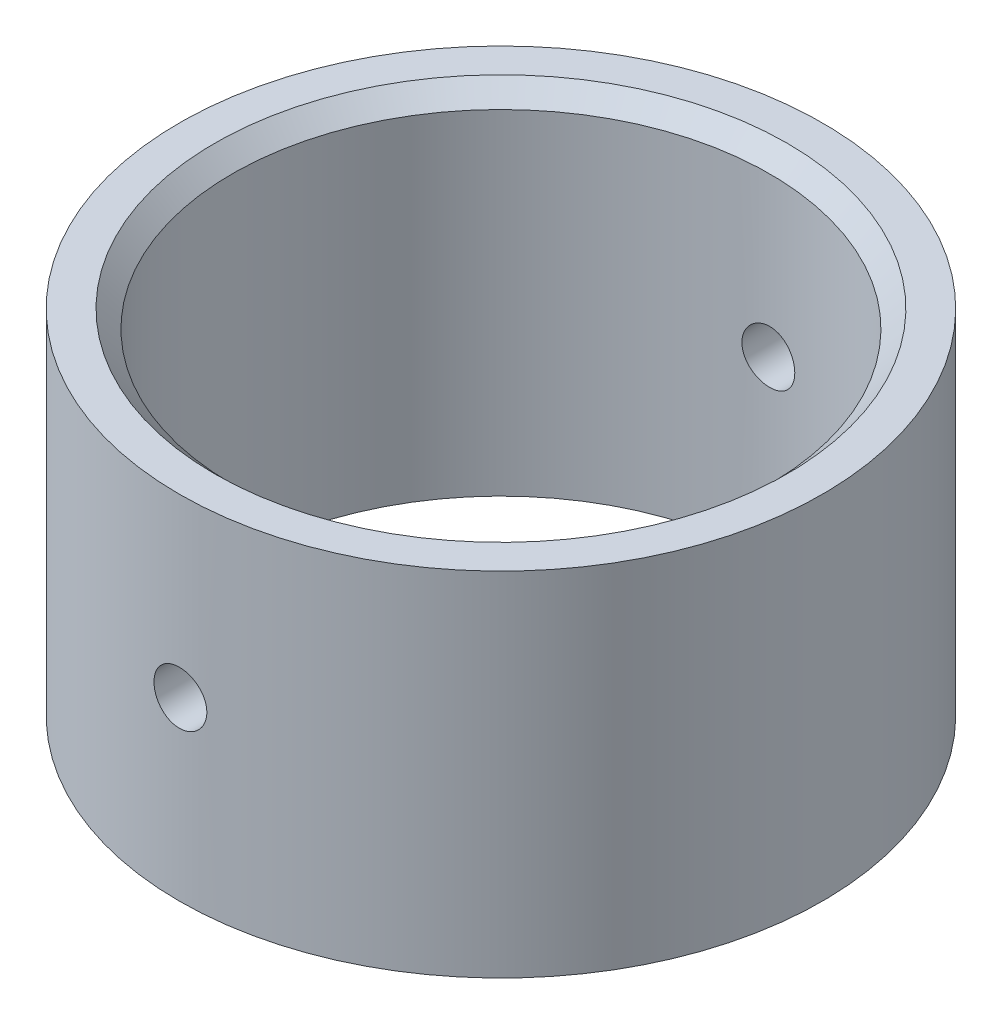
ISO-10303-21;
HEADER;
FILE_DESCRIPTION(('STEP AP214'),'2;1');
FILE_NAME('part.step','',(''),(''),'','','');
FILE_SCHEMA(('AUTOMOTIVE_DESIGN { 1 0 10303 214 1 1 1 1 }'));
ENDSEC;
DATA;
#1=APPLICATION_CONTEXT('core data for automotive mechanical design processes');
#2=APPLICATION_PROTOCOL_DEFINITION('international standard','automotive_design',2000,#1);
#3=PRODUCT_CONTEXT('',#1,'mechanical');
#4=PRODUCT('Part','Part','',(#3));
#5=PRODUCT_RELATED_PRODUCT_CATEGORY('part','',(#4));
#6=PRODUCT_DEFINITION_FORMATION('','',#4);
#7=PRODUCT_DEFINITION_CONTEXT('part definition',#1,'design');
#8=PRODUCT_DEFINITION('design','',#6,#7);
#9=PRODUCT_DEFINITION_SHAPE('','',#8);
#10=(LENGTH_UNIT() NAMED_UNIT(*) SI_UNIT(.MILLI.,.METRE.));
#11=(NAMED_UNIT(*) PLANE_ANGLE_UNIT() SI_UNIT($,.RADIAN.));
#12=(NAMED_UNIT(*) SI_UNIT($,.STERADIAN.) SOLID_ANGLE_UNIT());
#13=UNCERTAINTY_MEASURE_WITH_UNIT(LENGTH_MEASURE(1.E-05),#10,'distance_accuracy_value','');
#14=(GEOMETRIC_REPRESENTATION_CONTEXT(3) GLOBAL_UNCERTAINTY_ASSIGNED_CONTEXT((#13)) GLOBAL_UNIT_ASSIGNED_CONTEXT((#10,
#11,#12)) REPRESENTATION_CONTEXT('',''));
#15=CARTESIAN_POINT('',(0.,0.,0.));
#16=DIRECTION('',(0.,0.,1.));
#17=DIRECTION('',(1.,0.,0.));
#18=AXIS2_PLACEMENT_3D('',#15,#16,#17);
#19=CARTESIAN_POINT('',(0.,20.,0.));
#20=DIRECTION('',(0.,1.,0.));
#21=DIRECTION('',(0.,0.,1.));
#22=AXIS2_PLACEMENT_3D('',#19,#20,#21);
#23=PLANE('',#22);
#24=CARTESIAN_POINT('',(0.,20.,0.));
#25=DIRECTION('',(0.,1.,0.));
#26=DIRECTION('',(0.,0.,1.));
#27=AXIS2_PLACEMENT_3D('',#24,#25,#26);
#28=CIRCLE('',#27,16.25);
#29=CARTESIAN_POINT('',(0.,20.,16.25));
#30=VERTEX_POINT('',#29);
#31=EDGE_CURVE('E10',#30,#30,#28,.F.);
#32=ORIENTED_EDGE('',*,*,#31,.T.);
#33=EDGE_LOOP('',(#32));
#34=FACE_BOUND('',#33,.T.);
#35=CARTESIAN_POINT('',(0.,20.,0.));
#36=DIRECTION('',(0.,1.,0.));
#37=DIRECTION('',(0.,0.,1.));
#38=AXIS2_PLACEMENT_3D('',#35,#36,#37);
#39=CIRCLE('',#38,18.25);
#40=CARTESIAN_POINT('',(0.,20.,18.25));
#41=VERTEX_POINT('',#40);
#42=EDGE_CURVE('E42',#41,#41,#39,.T.);
#43=ORIENTED_EDGE('',*,*,#42,.T.);
#44=EDGE_LOOP('',(#43));
#45=FACE_BOUND('',#44,.T.);
#46=ADVANCED_FACE('F31',(#34,#45),#23,.T.);
#47=CARTESIAN_POINT('',(0.,0.,0.));
#48=DIRECTION('',(0.,1.,0.));
#49=DIRECTION('',(0.,0.,1.));
#50=AXIS2_PLACEMENT_3D('',#47,#48,#49);
#51=PLANE('',#50);
#52=CARTESIAN_POINT('',(0.,0.,0.));
#53=DIRECTION('',(0.,1.,0.));
#54=DIRECTION('',(0.,0.,1.));
#55=AXIS2_PLACEMENT_3D('',#52,#53,#54);
#56=CIRCLE('',#55,18.25);
#57=CARTESIAN_POINT('',(0.,0.,18.25));
#58=VERTEX_POINT('',#57);
#59=EDGE_CURVE('E46',#58,#58,#56,.T.);
#60=ORIENTED_EDGE('',*,*,#59,.F.);
#61=EDGE_LOOP('',(#60));
#62=FACE_BOUND('',#61,.T.);
#63=CARTESIAN_POINT('',(0.,0.,0.));
#64=DIRECTION('',(0.,1.,0.));
#65=DIRECTION('',(0.,0.,1.));
#66=AXIS2_PLACEMENT_3D('',#63,#64,#65);
#67=CIRCLE('',#66,15.25);
#68=CARTESIAN_POINT('',(0.,0.,15.25));
#69=VERTEX_POINT('',#68);
#70=EDGE_CURVE('E99',#69,#69,#67,.T.);
#71=ORIENTED_EDGE('',*,*,#70,.T.);
#72=EDGE_LOOP('',(#71));
#73=FACE_BOUND('',#72,.T.);
#74=ADVANCED_FACE('F85',(#62,#73),#51,.F.);
#75=CARTESIAN_POINT('',(0.,20.,0.));
#76=DIRECTION('',(0.,-1.,0.));
#77=DIRECTION('',(0.,0.,-1.));
#78=AXIS2_PLACEMENT_3D('',#75,#76,#77);
#79=CYLINDRICAL_SURFACE('',#78,18.25);
#80=CARTESIAN_POINT('',(0.,11.5,-18.25));
#81=CARTESIAN_POINT('',(-0.0841033826820549,11.4999963247694,-18.2499991916306));
#82=CARTESIAN_POINT('',(-0.16826412108387,11.4929028298183,-18.2494124274523));
#83=CARTESIAN_POINT('',(-0.334257332310782,11.4647097572002,-18.2471281241413));
#84=CARTESIAN_POINT('',(-0.416087052855594,11.4435942846544,-18.2454293244709));
#85=CARTESIAN_POINT('',(-0.574990086714536,11.3879717323979,-18.2411129357132));
#86=CARTESIAN_POINT('',(-0.652066051695254,11.3534721981267,-18.2384958643928));
#87=CARTESIAN_POINT('',(-0.799314600326905,11.2720742597921,-18.2326364761272));
#88=CARTESIAN_POINT('',(-0.869488662670324,11.2251785195179,-18.2293942935509));
#89=CARTESIAN_POINT('',(-1.00113424383566,11.1201935136794,-18.222639531688));
#90=CARTESIAN_POINT('',(-1.06258626391228,11.0620798328664,-18.2191263728369));
#91=CARTESIAN_POINT('',(-1.17487609034631,10.9363601120165,-18.2122304811423));
#92=CARTESIAN_POINT('',(-1.22571343187489,10.868753656497,-18.2088477540159));
#93=CARTESIAN_POINT('',(-1.31539654335486,10.725849776121,-18.2025894617794));
#94=CARTESIAN_POINT('',(-1.35422521999643,10.6505415894158,-18.199714622075));
#95=CARTESIAN_POINT('',(-1.41867960000985,10.494446995329,-18.1948041804539));
#96=CARTESIAN_POINT('',(-1.44430553088215,10.4136606823699,-18.1927685640764));
#97=CARTESIAN_POINT('',(-1.48157054948887,10.2490980967868,-18.1897718797572));
#98=CARTESIAN_POINT('',(-1.49324134994048,10.1653290505604,-18.188808375812));
#99=CARTESIAN_POINT('',(-1.50236278192226,9.99701590678463,-18.1880572931551));
#100=CARTESIAN_POINT('',(-1.49981367373315,9.9124718234499,-18.1882696929198));
#101=CARTESIAN_POINT('',(-1.48059386388604,9.74522575062235,-18.1898442070803));
#102=CARTESIAN_POINT('',(-1.46395761837834,9.66251977135163,-18.1912035161872));
#103=CARTESIAN_POINT('',(-1.41708930155407,9.50107802566719,-18.1949142851865));
#104=CARTESIAN_POINT('',(-1.38685710062124,9.42234229711158,-18.1972657545377));
#105=CARTESIAN_POINT('',(-1.31361644208076,9.27096621066433,-18.2026991167464));
#106=CARTESIAN_POINT('',(-1.27059251489085,9.19833337045525,-18.2057818930871));
#107=CARTESIAN_POINT('',(-1.17300085065535,9.06130705064436,-18.2123296926334));
#108=CARTESIAN_POINT('',(-1.11843288627479,8.99691373334232,-18.2157947233661));
#109=CARTESIAN_POINT('',(-0.999108826704676,8.87799399685523,-18.222729081455));
#110=CARTESIAN_POINT('',(-0.934322941738477,8.82349746321468,-18.226198390987));
#111=CARTESIAN_POINT('',(-0.796506034442221,8.72614928567775,-18.2327405823088));
#112=CARTESIAN_POINT('',(-0.723475006798153,8.68329764928659,-18.2358134638431));
#113=CARTESIAN_POINT('',(-0.571221552451088,8.61045756882419,-18.2412171282726));
#114=CARTESIAN_POINT('',(-0.491998495356491,8.58047043647062,-18.2435478354864));
#115=CARTESIAN_POINT('',(-0.329618699070076,8.53423145313663,-18.2472036665982));
#116=CARTESIAN_POINT('',(-0.246462039329252,8.51797932486126,-18.2485288107975));
#117=CARTESIAN_POINT('',(-0.0788346090500717,8.49970913032381,-18.2500216009519));
#118=CARTESIAN_POINT('',(0.00563163341775037,8.49764978190901,-18.2501926038962));
#119=CARTESIAN_POINT('',(0.173708178116378,8.50771547709155,-18.249366807582));
#120=CARTESIAN_POINT('',(0.257318488103834,8.51984039203296,-18.2483700189156));
#121=CARTESIAN_POINT('',(0.421192156003401,8.55789621827376,-18.2453229061272));
#122=CARTESIAN_POINT('',(0.501459984159457,8.58380800678235,-18.243274041402));
#123=CARTESIAN_POINT('',(0.656508619485949,8.64868251482734,-18.2383529606205));
#124=CARTESIAN_POINT('',(0.731289342170315,8.68764543526327,-18.23548073189));
#125=CARTESIAN_POINT('',(0.873428956484776,8.7776200186838,-18.229226578642));
#126=CARTESIAN_POINT('',(0.940770476170412,8.82865904418623,-18.2258435030199));
#127=CARTESIAN_POINT('',(1.06594477649008,8.94129748207894,-18.2189516521085));
#128=CARTESIAN_POINT('',(1.1237773963807,9.00289707295459,-18.2154428746955));
#129=CARTESIAN_POINT('',(1.22843373606731,9.1350871299462,-18.2086851566566));
#130=CARTESIAN_POINT('',(1.27523052645887,9.2056989540896,-18.2054368641382));
#131=CARTESIAN_POINT('',(1.35630219985297,9.35380269105062,-18.1995770147));
#132=CARTESIAN_POINT('',(1.39057720495719,9.43129453677102,-18.1969654515712));
#133=CARTESIAN_POINT('',(1.44558644697801,9.59086306775327,-18.1926783461814));
#134=CARTESIAN_POINT('',(1.46633719764811,9.67293402819619,-18.191001662751));
#135=CARTESIAN_POINT('',(1.49376266925273,9.8394095579376,-18.1887703100142));
#136=CARTESIAN_POINT('',(1.50043765231854,9.92381408374875,-18.188215619813));
#137=CARTESIAN_POINT('',(1.49951911698866,10.0922931792558,-18.1882913508195));
#138=CARTESIAN_POINT('',(1.49196791193438,10.1763679844606,-18.1889182575733));
#139=CARTESIAN_POINT('',(1.46289955152067,10.3420510289013,-18.1912790794906));
#140=CARTESIAN_POINT('',(1.44138237456581,10.423659264323,-18.1930129963657));
#141=CARTESIAN_POINT('',(1.38500351565697,10.5820955763544,-18.1973915465925));
#142=CARTESIAN_POINT('',(1.35014256350936,10.6589239141222,-18.2000361301366));
#143=CARTESIAN_POINT('',(1.26807051698617,10.8056443721384,-18.2059381086704));
#144=CARTESIAN_POINT('',(1.22085962423588,10.8755366056001,-18.2091954936553));
#145=CARTESIAN_POINT('',(1.1152689190313,11.0066173433897,-18.2159675589272));
#146=CARTESIAN_POINT('',(1.0568578048252,11.0677805964567,-18.2194829428453));
#147=CARTESIAN_POINT('',(0.930580963773262,11.1794592974978,-18.2263684964757));
#148=CARTESIAN_POINT('',(0.862712951118477,11.2299721637466,-18.2297386308214));
#149=CARTESIAN_POINT('',(0.719321445537896,11.3189819750682,-18.2359598702598));
#150=CARTESIAN_POINT('',(0.643784231748272,11.3574568629384,-18.2388100186456));
#151=CARTESIAN_POINT('',(0.487350138689156,11.4211282199983,-18.2436588547167));
#152=CARTESIAN_POINT('',(0.406459548930427,11.4463399704515,-18.2456585217816));
#153=CARTESIAN_POINT('',(0.27090887585499,11.4763402634274,-18.2480670786529));
#154=CARTESIAN_POINT('',(0.217120828345763,11.4852008918408,-18.2487886292316));
#155=CARTESIAN_POINT('',(0.108896536014932,11.4970319424857,-18.2497553510186));
#156=CARTESIAN_POINT('',(0.0544602928599105,11.5000023798583,-18.2500005234514));
#157=CARTESIAN_POINT('',(0.,11.5,-18.25));
#158=B_SPLINE_CURVE_WITH_KNOTS('',3,(#80,#81,#82,#83,#84,#85,#86,#87,#88,#89,#90,#91,#92,#93,
#94,#95,#96,#97,#98,#99,#100,#101,#102,#103,#104,#105,#106,#107,#108,#109,#110,#111,#112,#113,
#114,#115,#116,#117,#118,#119,#120,#121,#122,#123,#124,#125,#126,#127,#128,#129,#130,#131,#132,
#133,#134,#135,#136,#137,#138,#139,#140,#141,#142,#143,#144,#145,#146,#147,#148,#149,#150,#151,
#152,#153,#154,#155,#156,#157),.UNSPECIFIED.,.T.,.F.,(4,2,2,2,2,2,2,2,2,2,2,2,2,2,2,2,2,2,2,2,2,
2,2,2,2,2,2,2,2,2,2,2,2,2,2,2,2,2,4),(0.,0.252111310133436,0.504508894782302,0.756764393292422,
1.00896572926402,1.26172228619577,1.5144899093038,1.76761568699489,2.02073710285424,
2.27328220616389,2.52582268691197,2.77774724966027,3.02967421416786,3.28190709263438,
3.53414493874699,3.78713224750037,4.04011971930557,4.29313298062505,4.54614113375722,
4.79841305719662,5.05068269246448,5.30260333115934,5.55452784791353,5.80702874596615,
6.05953391198712,6.31264900364852,6.56576162708313,6.81856460612639,7.07136287720919,
7.32341043032077,7.57545837317162,7.82749253282287,8.07952257801782,8.33226752856757,
8.58507367593175,8.83834036372122,9.09131460497696,9.25456714773208,9.41781927083714),.UNSPECIFIED.);
#159=CARTESIAN_POINT('',(0.,11.5,-18.25));
#160=VERTEX_POINT('',#159);
#161=EDGE_CURVE('E77',#160,#160,#158,.T.);
#162=ORIENTED_EDGE('',*,*,#161,.T.);
#163=EDGE_LOOP('',(#162));
#164=FACE_BOUND('',#163,.T.);
#165=CARTESIAN_POINT('',(1.5,10.,18.1882517026788));
#166=CARTESIAN_POINT('',(1.4999963242818,9.91589715835575,18.1882525212708));
#167=CARTESIAN_POINT('',(1.49290291750985,9.83173695922916,18.188841322134));
#168=CARTESIAN_POINT('',(1.46471022699765,9.66574486850389,18.1911329018594));
#169=CARTESIAN_POINT('',(1.44359504652427,9.58391572960846,18.1928369450597));
#170=CARTESIAN_POINT('',(1.38797334872357,9.42501392548661,18.1971647096259));
#171=CARTESIAN_POINT('',(1.3534743907428,9.34793860366781,18.199787911757));
#172=CARTESIAN_POINT('',(1.27207780940331,9.20069113204335,18.2056577749623));
#173=CARTESIAN_POINT('',(1.22518284841243,9.13051750435245,18.2089043021203));
#174=CARTESIAN_POINT('',(1.12019862865747,8.9988714297305,18.2156641332688));
#175=CARTESIAN_POINT('',(1.06208478065082,8.93741861984887,18.219178012792));
#176=CARTESIAN_POINT('',(0.93636439415431,8.82512726984,18.2260713470535));
#177=CARTESIAN_POINT('',(0.868757442332751,8.77428919212023,18.2294507959304));
#178=CARTESIAN_POINT('',(0.725853129745034,8.68460531287829,18.2356999251555));
#179=CARTESIAN_POINT('',(0.650545092455002,8.64577646888013,18.2385688822647));
#180=CARTESIAN_POINT('',(0.494450823192028,8.58132173820303,18.2434675789143));
#181=CARTESIAN_POINT('',(0.413664684810343,8.55569562602476,18.2454973327879));
#182=CARTESIAN_POINT('',(0.249102622980811,8.51843022548819,18.2484849046587));
#183=CARTESIAN_POINT('',(0.165333929127781,8.50675920960426,18.2494451538796));
#184=CARTESIAN_POINT('',(-0.00297852550270361,8.49763722468114,18.2501937583479));
#185=CARTESIAN_POINT('',(-0.0875222721915077,8.50018599766909,18.2499821348553));
#186=CARTESIAN_POINT('',(-0.254769829480995,8.51940527911422,18.2484128455602));
#187=CARTESIAN_POINT('',(-0.337477590442875,8.53604166877746,18.2470579486792));
#188=CARTESIAN_POINT('',(-0.498922825162805,8.58291089239439,18.2433577018132));
#189=CARTESIAN_POINT('',(-0.577660262010031,8.6131438527251,18.2410123426222));
#190=CARTESIAN_POINT('',(-0.729038410323473,8.68638607890456,18.2355902760967));
#191=CARTESIAN_POINT('',(-0.801671690563888,8.72941063636865,18.2325126943169));
#192=CARTESIAN_POINT('',(-0.938698622680314,8.82700364326259,18.2259720681676));
#193=CARTESIAN_POINT('',(-1.00309211200228,8.88157232037774,18.2225090161959));
#194=CARTESIAN_POINT('',(-1.12201103481983,9.00089688263973,18.2155745873045));
#195=CARTESIAN_POINT('',(-1.17650672692738,9.06568241277675,18.2121032160464));
#196=CARTESIAN_POINT('',(-1.27385337604687,9.20349831134486,18.2055537016151));
#197=CARTESIAN_POINT('',(-1.3167043238344,9.27652868630707,18.2024755587534));
#198=CARTESIAN_POINT('',(-1.38954391001305,9.42878196993076,18.1970604341468));
#199=CARTESIAN_POINT('',(-1.4195310229704,9.50800561169303,18.1947235403101));
#200=CARTESIAN_POINT('',(-1.46576978807872,9.67038667791659,18.1910571884405));
#201=CARTESIAN_POINT('',(-1.48202172103528,9.75354402191955,18.1897277098118));
#202=CARTESIAN_POINT('',(-1.50029117977261,9.92117176081933,18.1882300359495));
#203=CARTESIAN_POINT('',(-1.50235017205854,10.0056376074085,18.1880584577913));
#204=CARTESIAN_POINT('',(-1.49228390594379,10.1737132745771,18.1888870812623));
#205=CARTESIAN_POINT('',(-1.4801587761907,10.2573231029136,18.1898872722638));
#206=CARTESIAN_POINT('',(-1.44210301542758,10.4211944240854,18.1929436515849));
#207=CARTESIAN_POINT('',(-1.41619172005447,10.5014604371529,18.1949983607591));
#208=CARTESIAN_POINT('',(-1.35131880678353,10.6565056607315,18.1999310318462));
#209=CARTESIAN_POINT('',(-1.31235698508878,10.7312847855372,18.2028090066151));
#210=CARTESIAN_POINT('',(-1.22238401048711,10.8734233259555,18.20907213211));
#211=CARTESIAN_POINT('',(-1.17134521573241,10.9407651926763,18.2124584397125));
#212=CARTESIAN_POINT('',(-1.05870703980439,11.0659403008087,18.2193527552112));
#213=CARTESIAN_POINT('',(-0.997107481809894,11.1237733829809,18.2228607651443));
#214=CARTESIAN_POINT('',(-0.864917219944312,11.2284307004959,18.229613279768));
#215=CARTESIAN_POINT('',(-0.794305152814782,11.2752280006171,18.2328571273466));
#216=CARTESIAN_POINT('',(-0.646200795968616,11.3563005687744,18.2387063518087));
#217=CARTESIAN_POINT('',(-0.568708573404729,11.390575959012,18.2413117349229));
#218=CARTESIAN_POINT('',(-0.409140297438845,11.4455854603983,18.2455874428452));
#219=CARTESIAN_POINT('',(-0.327070026577155,11.4663362520937,18.2472589191215));
#220=CARTESIAN_POINT('',(-0.16059594946841,11.4937620394869,18.2494831532368));
#221=CARTESIAN_POINT('',(-0.0761921860987777,11.5004372936458,18.2500359316178));
#222=CARTESIAN_POINT('',(0.0922873915420816,11.4995195402187,18.2499605204771));
#223=CARTESIAN_POINT('',(0.176363439279602,11.4919685206361,18.2493358062526));
#224=CARTESIAN_POINT('',(0.342049014576111,11.4629000936491,18.2469824810486));
#225=CARTESIAN_POINT('',(0.423658538711108,11.4413826668577,18.2452538685368));
#226=CARTESIAN_POINT('',(0.582097402085197,11.3850028318932,18.2408867191846));
#227=CARTESIAN_POINT('',(0.658926999915741,11.3501411463684,18.2382482316184));
#228=CARTESIAN_POINT('',(0.805649671385804,11.2680672437101,18.2323565779693));
#229=CARTESIAN_POINT('',(0.875542859017125,11.2208552295861,18.2291034219902));
#230=CARTESIAN_POINT('',(1.00662351746884,11.115263300941,18.2223361903265));
#231=CARTESIAN_POINT('',(1.06778594248839,11.0568523404414,18.2188214063221));
#232=CARTESIAN_POINT('',(1.17946304476235,10.9305761461237,18.211933073847));
#233=CARTESIAN_POINT('',(1.22997513813646,10.8627086246641,18.2085595598087));
#234=CARTESIAN_POINT('',(1.31898412906102,10.7193175092938,18.2023290133249));
#235=CARTESIAN_POINT('',(1.35745882757087,10.6437801065077,18.199472939162));
#236=CARTESIAN_POINT('',(1.42112977805285,10.4873456105606,18.1946123687156));
#237=CARTESIAN_POINT('',(1.4463413140157,10.4064548080699,18.1926068927523));
#238=CARTESIAN_POINT('',(1.47634099506982,10.2709047101639,18.1901909689274));
#239=CARTESIAN_POINT('',(1.4852013481995,10.2171174938445,18.189467081297));
#240=CARTESIAN_POINT('',(1.49703203308136,10.1088948672314,18.188497183761));
#241=CARTESIAN_POINT('',(1.50000238015291,10.054459458624,18.1882511726126));
#242=CARTESIAN_POINT('',(1.5,10.,18.1882517026788));
#243=B_SPLINE_CURVE_WITH_KNOTS('',3,(#165,#166,#167,#168,#169,#170,#171,#172,#173,#174,#175,
#176,#177,#178,#179,#180,#181,#182,#183,#184,#185,#186,#187,#188,#189,#190,#191,#192,#193,#194,
#195,#196,#197,#198,#199,#200,#201,#202,#203,#204,#205,#206,#207,#208,#209,#210,#211,#212,#213,
#214,#215,#216,#217,#218,#219,#220,#221,#222,#223,#224,#225,#226,#227,#228,#229,#230,#231,#232,
#233,#234,#235,#236,#237,#238,#239,#240,#241,#242),.UNSPECIFIED.,.T.,.F.,(4,2,2,2,2,2,2,2,2,2,2,
2,2,2,2,2,2,2,2,2,2,2,2,2,2,2,2,2,2,2,2,2,2,2,2,2,2,2,4),(0.,0.252109685100551,
0.504505680499107,0.756759326138553,1.00895883762811,1.26171752082518,1.51448721260213,
1.76761221285532,2.0207328896539,2.27327698452086,2.52581649779292,2.77774612925232,
3.02967810238877,3.28191246497242,3.53415180285194,3.78713697553712,4.04012234862459,
4.2931377132217,4.54614790498207,4.79841858036985,5.05068696772299,5.30260246788833,
5.55452190214778,5.80702360558093,6.05952953711847,6.31264552908829,6.56575905082807,
6.81855980159666,7.07135591028909,7.3234070748771,7.57545858934264,7.82749645607768,
8.07953018017854,8.33227297366639,8.58507701478611,8.83834455909055,9.09131960412957,
9.25456964902764,9.41781926932601),.UNSPECIFIED.);
#244=CARTESIAN_POINT('',(1.5,10.,18.1882517026788));
#245=VERTEX_POINT('',#244);
#246=EDGE_CURVE('E56',#245,#245,#243,.T.);
#247=ORIENTED_EDGE('',*,*,#246,.T.);
#248=EDGE_LOOP('',(#247));
#249=FACE_BOUND('',#248,.T.);
#250=ORIENTED_EDGE('',*,*,#42,.F.);
#251=EDGE_LOOP('',(#250));
#252=FACE_BOUND('',#251,.T.);
#253=ORIENTED_EDGE('',*,*,#59,.T.);
#254=EDGE_LOOP('',(#253));
#255=FACE_BOUND('',#254,.T.);
#256=ADVANCED_FACE('F81',(#164,#249,#252,#255),#79,.T.);
#257=CARTESIAN_POINT('',(0.,20.,0.));
#258=DIRECTION('',(0.,-1.,0.));
#259=DIRECTION('',(0.,0.,-1.));
#260=AXIS2_PLACEMENT_3D('',#257,#258,#259);
#261=CYLINDRICAL_SURFACE('',#260,15.25);
#262=CARTESIAN_POINT('',(0.,19.,0.));
#263=DIRECTION('',(0.,1.,0.));
#264=DIRECTION('',(0.,0.,1.));
#265=AXIS2_PLACEMENT_3D('',#262,#263,#264);
#266=CIRCLE('',#265,15.25);
#267=CARTESIAN_POINT('',(0.,19.,15.25));
#268=VERTEX_POINT('',#267);
#269=EDGE_CURVE('E38',#268,#268,#266,.T.);
#270=ORIENTED_EDGE('',*,*,#269,.T.);
#271=EDGE_LOOP('',(#270));
#272=FACE_BOUND('',#271,.T.);
#273=CARTESIAN_POINT('',(0.,11.5,-15.25));
#274=CARTESIAN_POINT('',(-0.0840378240693164,11.4999963572924,-15.2499990470129));
#275=CARTESIAN_POINT('',(-0.168131384984485,11.4929138689533,-15.2492979581456));
#276=CARTESIAN_POINT('',(-0.333987605582531,11.4647670712714,-15.2465685906622));
#277=CARTESIAN_POINT('',(-0.415747585283655,11.4436873114772,-15.2445388454855));
#278=CARTESIAN_POINT('',(-0.574510830247281,11.3881651345915,-15.2393813136949));
#279=CARTESIAN_POINT('',(-0.651516917032348,11.3537307338534,-15.2362541859108));
#280=CARTESIAN_POINT('',(-0.798639363461378,11.2724921740253,-15.2292516651195));
#281=CARTESIAN_POINT('',(-0.868757100283726,11.2256904944408,-15.2253764221433));
#282=CARTESIAN_POINT('',(-1.00037394702792,11.1208706475552,-15.2172967393301));
#283=CARTESIAN_POINT('',(-1.06184567063484,11.0628181652544,-15.2130913164013));
#284=CARTESIAN_POINT('',(-1.17419019390972,10.9372177375489,-15.204833392901));
#285=CARTESIAN_POINT('',(-1.22506250602922,10.8696693555938,-15.2007808993709));
#286=CARTESIAN_POINT('',(-1.31486069194246,10.7268237313961,-15.1932775691641));
#287=CARTESIAN_POINT('',(-1.35376185509278,10.6515108837717,-15.189827983253));
#288=CARTESIAN_POINT('',(-1.41835568990779,10.4953824489843,-15.183933132639));
#289=CARTESIAN_POINT('',(-1.4440486779544,10.4145669936806,-15.1814878438799));
#290=CARTESIAN_POINT('',(-1.48141581879227,10.2500062182436,-15.1778872725114));
#291=CARTESIAN_POINT('',(-1.49313531402324,10.1662712869077,-15.1767278183714));
#292=CARTESIAN_POINT('',(-1.50236294852443,9.99801553268154,-15.1758172177995));
#293=CARTESIAN_POINT('',(-1.49987144993738,9.91349472987272,-15.1760660354802));
#294=CARTESIAN_POINT('',(-1.48078520458621,9.74637883374287,-15.1779400580466));
#295=CARTESIAN_POINT('',(-1.46423994122878,9.66377802717587,-15.1795604335975));
#296=CARTESIAN_POINT('',(-1.41759280811924,9.50253137986258,-15.1839874489418));
#297=CARTESIAN_POINT('',(-1.38749076059893,9.42388559099292,-15.1867941042907));
#298=CARTESIAN_POINT('',(-1.31452984246402,9.27262498356142,-15.1932829963569));
#299=CARTESIAN_POINT('',(-1.27164899150083,9.20002083452364,-15.1969667395078));
#300=CARTESIAN_POINT('',(-1.17436349645407,9.06302121872212,-15.2047934548374));
#301=CARTESIAN_POINT('',(-1.11995852611915,8.99862598443794,-15.2089364400159));
#302=CARTESIAN_POINT('',(-1.00089264937023,8.87958457795478,-15.217236344013));
#303=CARTESIAN_POINT('',(-0.93618900323917,8.82498114402624,-15.2213932469236));
#304=CARTESIAN_POINT('',(-0.798510957720883,8.72740449798239,-15.2292359099366));
#305=CARTESIAN_POINT('',(-0.72553654951211,8.68443129827199,-15.2329216695366));
#306=CARTESIAN_POINT('',(-0.573359039440278,8.6113367869129,-15.239407913987));
#307=CARTESIAN_POINT('',(-0.49415490343125,8.58121761441091,-15.2422082514668));
#308=CARTESIAN_POINT('',(-0.331780085454388,8.53471730411781,-15.2466066057121));
#309=CARTESIAN_POINT('',(-0.248609518310464,8.51833576889173,-15.24820465726));
#310=CARTESIAN_POINT('',(-0.0810328961737496,8.49982989622543,-15.2500139138618));
#311=CARTESIAN_POINT('',(0.00336658597340139,8.49764657703323,-15.2502308561938));
#312=CARTESIAN_POINT('',(0.171330280183945,8.50744424154596,-15.2492688283088));
#313=CARTESIAN_POINT('',(0.254894503144274,8.51942504021948,-15.2480898763269));
#314=CARTESIAN_POINT('',(0.418645578164813,8.55716192262786,-15.2444722293549));
#315=CARTESIAN_POINT('',(0.498838848187798,8.5828904193258,-15.2420360575187));
#316=CARTESIAN_POINT('',(0.653771048178059,8.64736402795338,-15.2361773157838));
#317=CARTESIAN_POINT('',(0.728509859588747,8.68610942271218,-15.2327547244527));
#318=CARTESIAN_POINT('',(0.870678441855162,8.77566346946138,-15.2252917801693));
#319=CARTESIAN_POINT('',(0.93808367572066,8.82651090745478,-15.2212494561639));
#320=CARTESIAN_POINT('',(1.06342341374137,8.93877001157579,-15.2130070548012));
#321=CARTESIAN_POINT('',(1.12135768797467,9.00018193409802,-15.208806973617));
#322=CARTESIAN_POINT('',(1.22631549438524,9.13208395410557,-15.2007052013486));
#323=CARTESIAN_POINT('',(1.27330034014239,9.20260491171492,-15.1968045999735));
#324=CARTESIAN_POINT('',(1.35475968697277,9.3505708094291,-15.1897598735202));
#325=CARTESIAN_POINT('',(1.38923435430012,9.42801565750179,-15.1866157383893));
#326=CARTESIAN_POINT('',(1.44462984973677,9.58749782936524,-15.1814466571036));
#327=CARTESIAN_POINT('',(1.46557376676091,9.66952706899018,-15.1794198052854));
#328=CARTESIAN_POINT('',(1.49338818304006,9.83595884662559,-15.1767088048111));
#329=CARTESIAN_POINT('',(1.50025907163034,9.92036131891425,-15.1760246190098));
#330=CARTESIAN_POINT('',(1.49972708565035,10.0887591742975,-15.1760771708159));
#331=CARTESIAN_POINT('',(1.49238498373053,10.1727547578863,-15.1768078586363));
#332=CARTESIAN_POINT('',(1.46376278034807,10.3383131406689,-15.1795949323358));
#333=CARTESIAN_POINT('',(1.44248266254013,10.4198759370096,-15.1816513197696));
#334=CARTESIAN_POINT('',(1.38660511735633,10.5782534802894,-15.1868564199118));
#335=CARTESIAN_POINT('',(1.3520094021837,10.6550688362112,-15.190004992175));
#336=CARTESIAN_POINT('',(1.27048902403659,10.8018120801544,-15.1970399779361));
#337=CARTESIAN_POINT('',(1.22356444324792,10.871740014084,-15.2009263865154));
#338=CARTESIAN_POINT('',(1.11849006425634,11.0030348535302,-15.2090190370884));
#339=CARTESIAN_POINT('',(1.06029500108095,11.064365457739,-15.2132265258757));
#340=CARTESIAN_POINT('',(0.93442058083267,11.1764178310247,-15.2214758670066));
#341=CARTESIAN_POINT('',(0.86673895294831,11.2271370527739,-15.2255176793918));
#342=CARTESIAN_POINT('',(0.723632349531375,11.3166237803139,-15.2329904773237));
#343=CARTESIAN_POINT('',(0.648188831961072,11.3553617376604,-15.2364199440324));
#344=CARTESIAN_POINT('',(0.491882762818942,11.4195683128382,-15.2422650147616));
#345=CARTESIAN_POINT('',(0.411026451202972,11.4450519229897,-15.244681763688));
#346=CARTESIAN_POINT('',(0.274758611388643,11.4756575784127,-15.2476204431535));
#347=CARTESIAN_POINT('',(0.220218749204184,11.484773550256,-15.248508626419));
#348=CARTESIAN_POINT('',(0.110460617712434,11.4969459463258,-15.2496987169055));
#349=CARTESIAN_POINT('',(0.0552423510913281,11.5000023945376,-15.250000626447));
#350=CARTESIAN_POINT('',(0.,11.5,-15.25));
#351=B_SPLINE_CURVE_WITH_KNOTS('',3,(#273,#274,#275,#276,#277,#278,#279,#280,#281,#282,#283,
#284,#285,#286,#287,#288,#289,#290,#291,#292,#293,#294,#295,#296,#297,#298,#299,#300,#301,#302,
#303,#304,#305,#306,#307,#308,#309,#310,#311,#312,#313,#314,#315,#316,#317,#318,#319,#320,#321,
#322,#323,#324,#325,#326,#327,#328,#329,#330,#331,#332,#333,#334,#335,#336,#337,#338,#339,#340,
#341,#342,#343,#344,#345,#346,#347,#348,#349,#350),.UNSPECIFIED.,.T.,.F.,(4,2,2,2,2,2,2,2,2,2,2,
2,2,2,2,2,2,2,2,2,2,2,2,2,2,2,2,2,2,2,2,2,2,2,2,2,2,2,4),(0.,0.251911750923153,
0.504102030038518,0.756141161312589,1.00812979975886,1.26089945658077,1.51368073765791,
1.76698035873976,2.02027391212853,2.27274329948862,2.52520625312962,2.77678395020398,
3.02836494627717,3.28038120008215,3.53240458949807,3.78550254436756,4.03860076919231,
4.29174109781039,4.54487410273161,4.79695487562047,5.04903235551587,5.30060588936844,
5.55218488972541,5.80458130170702,6.05698384008458,6.31026508353167,6.56354296087213,
6.8163874944445,7.06922503288983,7.32098386290659,7.57274298816496,7.82446975146177,
8.07619483675821,8.32895270044123,8.58177117076201,8.83520826505036,9.08835806348838,
9.25395317053882,9.41954762211635),.UNSPECIFIED.);
#352=CARTESIAN_POINT('',(0.,11.5,-15.25));
#353=VERTEX_POINT('',#352);
#354=EDGE_CURVE('E49',#353,#353,#351,.T.);
#355=ORIENTED_EDGE('',*,*,#354,.F.);
#356=EDGE_LOOP('',(#355));
#357=FACE_BOUND('',#356,.T.);
#358=CARTESIAN_POINT('',(1.5,10.,15.1760502107762));
#359=CARTESIAN_POINT('',(1.49999635630005,9.91596328468263,15.1760511810735));
#360=CARTESIAN_POINT('',(1.49291404853053,9.83187082902407,15.1767557571401));
#361=CARTESIAN_POINT('',(1.46476803328199,9.6660169048423,15.1794975814199));
#362=CARTESIAN_POINT('',(1.44368887151796,9.58425811716932,15.1815363026609));
#363=CARTESIAN_POINT('',(1.38816844405653,9.4254973927737,15.1867133036243));
#364=CARTESIAN_POINT('',(1.35373522314942,9.34849262443504,15.1898509212362));
#365=CARTESIAN_POINT('',(1.27249944174759,9.20137238715348,15.1968713680959));
#366=CARTESIAN_POINT('',(1.22569935786189,9.13125554267557,15.2007540480937));
#367=CARTESIAN_POINT('',(1.12088112289333,8.99963768834622,15.2088424639216));
#368=CARTESIAN_POINT('',(1.06282830031082,8.93816434744369,15.2130491733554));
#369=CARTESIAN_POINT('',(0.937226512974793,8.82581670275199,15.2213028116813));
#370=CARTESIAN_POINT('',(0.869677116084281,8.7749428815504,15.2253497332917));
#371=CARTESIAN_POINT('',(0.726830602585384,8.68514311754752,15.2328373942016));
#372=CARTESIAN_POINT('',(0.651518055128186,8.64624160824216,15.2362768878285));
#373=CARTESIAN_POINT('',(0.495390272747812,8.58164705065548,15.2421515704959));
#374=CARTESIAN_POINT('',(0.414575167973535,8.55595369009205,15.2445867832806));
#375=CARTESIAN_POINT('',(0.250015465825413,8.51858577090217,15.2481716912178));
#376=CARTESIAN_POINT('',(0.166281264194356,8.50686583723862,15.2493255464011));
#377=CARTESIAN_POINT('',(-0.00197306127701157,8.49763707304981,15.2502318735774));
#378=CARTESIAN_POINT('',(-0.0864931652986292,8.50012788512658,15.2499843808141));
#379=CARTESIAN_POINT('',(-0.253612089573553,8.51921304377201,15.2481193058343));
#380=CARTESIAN_POINT('',(-0.336216542248237,8.53575859799608,15.2465064636215));
#381=CARTESIAN_POINT('',(-0.497470331607446,8.58240757675174,15.2420974105691));
#382=CARTESIAN_POINT('',(-0.576119618337195,8.61251117247715,15.2393011847871));
#383=CARTESIAN_POINT('',(-0.727384465137451,8.68547529585957,15.2328316113153));
#384=CARTESIAN_POINT('',(-0.79998953098128,8.72835744257053,15.2291567792781));
#385=CARTESIAN_POINT('',(-0.936990430823596,8.82564570291134,15.2213424057234));
#386=CARTESIAN_POINT('',(-1.00138603185874,8.88005214345426,15.2172028510243));
#387=CARTESIAN_POINT('',(-1.12042577689634,8.99911906274169,15.2089029593052));
#388=CARTESIAN_POINT('',(-1.17502747950257,9.06382198110902,15.2047426085005));
#389=CARTESIAN_POINT('',(-1.27260097917591,9.20149795378748,15.1968875276416));
#390=CARTESIAN_POINT('',(-1.31557276025915,9.2744710194647,15.1931927982273));
#391=CARTESIAN_POINT('',(-1.38866625121725,9.42664816653329,15.1866869146949));
#392=CARTESIAN_POINT('',(-1.41878538372311,9.50585349392527,15.1838759378272));
#393=CARTESIAN_POINT('',(-1.46528524891123,9.66823090142461,15.1794594619165));
#394=CARTESIAN_POINT('',(-1.48166638625311,9.75140286461642,15.1778539273668));
#395=CARTESIAN_POINT('',(-1.5001707583248,9.91898013506735,15.1760362225094));
#396=CARTESIAN_POINT('',(-1.50235334831435,10.0033788277999,15.1758182517463));
#397=CARTESIAN_POINT('',(-1.49255450717225,10.1713407679773,15.1767850459988));
#398=CARTESIAN_POINT('',(-1.48057326109182,10.2549040263227,15.1779697926879));
#399=CARTESIAN_POINT('',(-1.44283649219485,10.4186503086617,15.1816032516219));
#400=CARTESIAN_POINT('',(-1.41710899601587,10.4988398535811,15.1840493917134));
#401=CARTESIAN_POINT('',(-1.35263863606021,10.6537650460384,15.1899279254468));
#402=CARTESIAN_POINT('',(-1.31389548355447,10.7285005725439,15.1933603409672));
#403=CARTESIAN_POINT('',(-1.22434473665341,10.8706669174573,15.2008387199748));
#404=CARTESIAN_POINT('',(-1.17349778658969,10.9380728396209,15.2048866690361));
#405=CARTESIAN_POINT('',(-1.06123925734781,11.0634141936792,15.2131334892362));
#406=CARTESIAN_POINT('',(-0.999827425124035,11.1213493986704,15.217332363988));
#407=CARTESIAN_POINT('',(-0.867924998606087,11.2263092151916,15.2254254098736));
#408=CARTESIAN_POINT('',(-0.797403528189959,11.2732951225596,15.2293184687948));
#409=CARTESIAN_POINT('',(-0.649436321892512,11.3547563320777,15.2363450632996));
#410=CARTESIAN_POINT('',(-0.571990678217735,11.3892318007937,15.2394786089953));
#411=CARTESIAN_POINT('',(-0.412509009513278,11.4446278264539,15.2446280763339));
#412=CARTESIAN_POINT('',(-0.330481189937255,11.4655718195466,15.2466459294469));
#413=CARTESIAN_POINT('',(-0.164052407123473,11.4933868691481,15.2493445696647));
#414=CARTESIAN_POINT('',(-0.0796515083231306,11.5002583074026,15.2500253930391));
#415=CARTESIAN_POINT('',(0.0887472914430994,11.4997279244381,15.2499732526592));
#416=CARTESIAN_POINT('',(0.172745390048359,11.4923862124663,15.2492462428098));
#417=CARTESIAN_POINT('',(0.338308900209895,11.4637639042241,15.2464718748656));
#418=CARTESIAN_POINT('',(0.419874309688881,11.4424832960516,15.2444245156433));
#419=CARTESIAN_POINT('',(0.578257089327699,11.3866037846749,15.239238874917));
#420=CARTESIAN_POINT('',(0.655075060036553,11.3520065700346,15.2361007317308));
#421=CARTESIAN_POINT('',(0.801822907801739,11.2704823834801,15.2290834678521));
#422=CARTESIAN_POINT('',(0.871752832386939,11.2235554966514,15.2252043522731));
#423=CARTESIAN_POINT('',(1.00304755570946,11.1184785813329,15.2171201916797));
#424=CARTESIAN_POINT('',(1.06437647355939,11.0602838152855,15.2129138888238));
#425=CARTESIAN_POINT('',(1.17642558325105,10.9344106831599,15.2046600799715));
#426=CARTESIAN_POINT('',(1.22714322334652,10.8667300424858,15.2006126123607));
#427=CARTESIAN_POINT('',(1.31662824867471,10.7236242434476,15.1931240243759));
#428=CARTESIAN_POINT('',(1.35536580136165,10.6481803653977,15.1896844266804));
#429=CARTESIAN_POINT('',(1.41957152013883,10.4918735316402,15.1838192055686));
#430=CARTESIAN_POINT('',(1.4450546840577,10.4110168182517,15.1813924367164));
#431=CARTESIAN_POINT('',(1.47565908216234,10.2747501722905,15.1784409293017));
#432=CARTESIAN_POINT('',(1.48477448810257,10.2202119946083,15.1775486369192));
#433=CARTESIAN_POINT('',(1.49694613239664,10.1104572378433,15.1763529599346));
#434=CARTESIAN_POINT('',(1.5000023951483,10.055240661493,15.1760495729613));
#435=CARTESIAN_POINT('',(1.5,10.,15.1760502107762));
#436=B_SPLINE_CURVE_WITH_KNOTS('',3,(#358,#359,#360,#361,#362,#363,#364,#365,#366,#367,#368,
#369,#370,#371,#372,#373,#374,#375,#376,#377,#378,#379,#380,#381,#382,#383,#384,#385,#386,#387,
#388,#389,#390,#391,#392,#393,#394,#395,#396,#397,#398,#399,#400,#401,#402,#403,#404,#405,#406,
#407,#408,#409,#410,#411,#412,#413,#414,#415,#416,#417,#418,#419,#420,#421,#422,#423,#424,#425,
#426,#427,#428,#429,#430,#431,#432,#433,#434,#435),.UNSPECIFIED.,.T.,.F.,(4,2,2,2,2,2,2,2,2,2,2,
2,2,2,2,2,2,2,2,2,2,2,2,2,2,2,2,2,2,2,2,2,2,2,2,2,2,2,4),(0.,0.251908420510321,
0.504095443080343,0.75613077782561,1.0081156777471,1.26088969277439,1.5136752138853,
1.76697325852606,2.02026531413012,2.27273261044166,2.5251935572693,2.77678162755763,
3.02837287467112,3.28039221000265,3.53241869539898,3.78551224436244,4.03860614116964,
4.29175076761191,4.54488793728867,4.79696621479017,5.04904119891298,5.30060418848323,
5.55217275889686,5.80457075833581,6.05697480394712,6.31025796696572,6.56353775761245,
6.81637769014854,7.06921076381206,7.32097690926696,7.57274326970045,7.82447771632807,
8.07621042581693,8.32896389607733,8.58177807752727,8.83521683418698,9.08836818823921,
9.25395823736338,9.41954761971969),.UNSPECIFIED.);
#437=CARTESIAN_POINT('',(1.5,10.,15.1760502107762));
#438=VERTEX_POINT('',#437);
#439=EDGE_CURVE('E57',#438,#438,#436,.T.);
#440=ORIENTED_EDGE('',*,*,#439,.F.);
#441=EDGE_LOOP('',(#440));
#442=FACE_BOUND('',#441,.T.);
#443=ORIENTED_EDGE('',*,*,#70,.F.);
#444=EDGE_LOOP('',(#443));
#445=FACE_BOUND('',#444,.T.);
#446=ADVANCED_FACE('F61',(#272,#357,#442,#445),#261,.F.);
#447=CARTESIAN_POINT('',(0.,10.,-18.25));
#448=DIRECTION('',(0.,0.,1.));
#449=DIRECTION('',(1.,0.,0.));
#450=AXIS2_PLACEMENT_3D('',#447,#448,#449);
#451=CYLINDRICAL_SURFACE('',#450,1.5);
#452=ORIENTED_EDGE('',*,*,#439,.T.);
#453=EDGE_LOOP('',(#452));
#454=FACE_BOUND('',#453,.T.);
#455=ORIENTED_EDGE('',*,*,#246,.F.);
#456=EDGE_LOOP('',(#455));
#457=FACE_BOUND('',#456,.T.);
#458=ADVANCED_FACE('F67',(#454,#457),#451,.F.);
#459=ORIENTED_EDGE('',*,*,#354,.T.);
#460=EDGE_LOOP('',(#459));
#461=FACE_BOUND('',#460,.T.);
#462=ORIENTED_EDGE('',*,*,#161,.F.);
#463=EDGE_LOOP('',(#462));
#464=FACE_BOUND('',#463,.T.);
#465=ADVANCED_FACE('F64',(#461,#464),#451,.F.);
#466=CARTESIAN_POINT('',(0.,19.,0.));
#467=DIRECTION('',(0.,1.,0.));
#468=DIRECTION('',(0.,0.,1.));
#469=AXIS2_PLACEMENT_3D('',#466,#467,#468);
#470=CONICAL_SURFACE('',#469,15.25,0.785398163397452);
#471=ORIENTED_EDGE('',*,*,#31,.F.);
#472=EDGE_LOOP('',(#471));
#473=FACE_BOUND('',#472,.T.);
#474=ORIENTED_EDGE('',*,*,#269,.F.);
#475=EDGE_LOOP('',(#474));
#476=FACE_BOUND('',#475,.T.);
#477=ADVANCED_FACE('F33',(#473,#476),#470,.F.);
#478=CLOSED_SHELL('',(#46,#74,#256,#446,#458,#465,#477));
#479=MANIFOLD_SOLID_BREP('B2',#478);
#480=ADVANCED_BREP_SHAPE_REPRESENTATION('',(#18,#479),#14);
#481=SHAPE_DEFINITION_REPRESENTATION(#9,#480);
ENDSEC;
END-ISO-10303-21;
